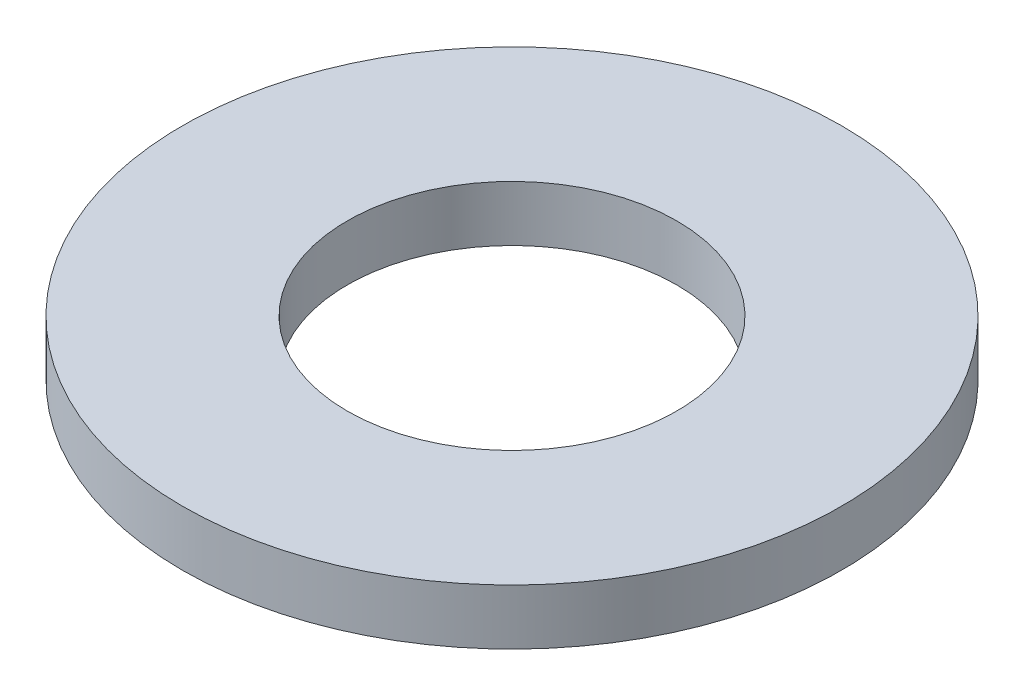
ISO-10303-21;
HEADER;
FILE_DESCRIPTION(('STEP AP214'),'2;1');
FILE_NAME('part.step','',(''),(''),'','','');
FILE_SCHEMA(('AUTOMOTIVE_DESIGN { 1 0 10303 214 1 1 1 1 }'));
ENDSEC;
DATA;
#1=APPLICATION_CONTEXT('core data for automotive mechanical design processes');
#2=APPLICATION_PROTOCOL_DEFINITION('international standard','automotive_design',2000,#1);
#3=PRODUCT_CONTEXT('',#1,'mechanical');
#4=PRODUCT('Part','Part','',(#3));
#5=PRODUCT_RELATED_PRODUCT_CATEGORY('part','',(#4));
#6=PRODUCT_DEFINITION_FORMATION('','',#4);
#7=PRODUCT_DEFINITION_CONTEXT('part definition',#1,'design');
#8=PRODUCT_DEFINITION('design','',#6,#7);
#9=PRODUCT_DEFINITION_SHAPE('','',#8);
#10=(LENGTH_UNIT() NAMED_UNIT(*) SI_UNIT(.MILLI.,.METRE.));
#11=(NAMED_UNIT(*) PLANE_ANGLE_UNIT() SI_UNIT($,.RADIAN.));
#12=(NAMED_UNIT(*) SI_UNIT($,.STERADIAN.) SOLID_ANGLE_UNIT());
#13=UNCERTAINTY_MEASURE_WITH_UNIT(LENGTH_MEASURE(1.E-05),#10,'distance_accuracy_value','');
#14=(GEOMETRIC_REPRESENTATION_CONTEXT(3) GLOBAL_UNCERTAINTY_ASSIGNED_CONTEXT((#13)) GLOBAL_UNIT_ASSIGNED_CONTEXT((#10,
#11,#12)) REPRESENTATION_CONTEXT('',''));
#15=CARTESIAN_POINT('',(0.,0.,0.));
#16=DIRECTION('',(0.,0.,1.));
#17=DIRECTION('',(1.,0.,0.));
#18=AXIS2_PLACEMENT_3D('',#15,#16,#17);
#19=CARTESIAN_POINT('',(0.,16.,0.));
#20=DIRECTION('',(0.,-1.,0.));
#21=DIRECTION('',(0.,0.,-1.));
#22=AXIS2_PLACEMENT_3D('',#19,#20,#21);
#23=CYLINDRICAL_SURFACE('',#22,95.);
#24=CARTESIAN_POINT('',(0.,16.,0.));
#25=DIRECTION('',(0.,1.,0.));
#26=DIRECTION('',(0.,0.,1.));
#27=AXIS2_PLACEMENT_3D('',#24,#25,#26);
#28=CIRCLE('',#27,95.);
#29=CARTESIAN_POINT('',(0.,16.,95.));
#30=VERTEX_POINT('',#29);
#31=EDGE_CURVE('E10',#30,#30,#28,.T.);
#32=ORIENTED_EDGE('',*,*,#31,.F.);
#33=EDGE_LOOP('',(#32));
#34=FACE_BOUND('',#33,.T.);
#35=CARTESIAN_POINT('',(0.,0.,0.));
#36=DIRECTION('',(0.,1.,0.));
#37=DIRECTION('',(0.,0.,1.));
#38=AXIS2_PLACEMENT_3D('',#35,#36,#37);
#39=CIRCLE('',#38,95.);
#40=CARTESIAN_POINT('',(0.,0.,95.));
#41=VERTEX_POINT('',#40);
#42=EDGE_CURVE('E37',#41,#41,#39,.T.);
#43=ORIENTED_EDGE('',*,*,#42,.T.);
#44=EDGE_LOOP('',(#43));
#45=FACE_BOUND('',#44,.T.);
#46=ADVANCED_FACE('F40',(#34,#45),#23,.T.);
#47=CARTESIAN_POINT('',(0.,16.,0.));
#48=DIRECTION('',(0.,1.,0.));
#49=DIRECTION('',(0.,0.,1.));
#50=AXIS2_PLACEMENT_3D('',#47,#48,#49);
#51=PLANE('',#50);
#52=CARTESIAN_POINT('',(0.,16.,0.));
#53=DIRECTION('',(0.,1.,0.));
#54=DIRECTION('',(0.,0.,1.));
#55=AXIS2_PLACEMENT_3D('',#52,#53,#54);
#56=CIRCLE('',#55,47.5);
#57=CARTESIAN_POINT('',(0.,16.,47.5));
#58=VERTEX_POINT('',#57);
#59=EDGE_CURVE('E50',#58,#58,#56,.T.);
#60=ORIENTED_EDGE('',*,*,#59,.F.);
#61=EDGE_LOOP('',(#60));
#62=FACE_BOUND('',#61,.T.);
#63=ORIENTED_EDGE('',*,*,#31,.T.);
#64=EDGE_LOOP('',(#63));
#65=FACE_BOUND('',#64,.T.);
#66=ADVANCED_FACE('F59',(#62,#65),#51,.T.);
#67=CARTESIAN_POINT('',(0.,0.,0.));
#68=DIRECTION('',(0.,1.,0.));
#69=DIRECTION('',(0.,0.,1.));
#70=AXIS2_PLACEMENT_3D('',#67,#68,#69);
#71=PLANE('',#70);
#72=CARTESIAN_POINT('',(0.,0.,0.));
#73=DIRECTION('',(0.,1.,0.));
#74=DIRECTION('',(0.,0.,1.));
#75=AXIS2_PLACEMENT_3D('',#72,#73,#74);
#76=CIRCLE('',#75,47.5);
#77=CARTESIAN_POINT('',(0.,0.,47.5));
#78=VERTEX_POINT('',#77);
#79=EDGE_CURVE('E47',#78,#78,#76,.T.);
#80=ORIENTED_EDGE('',*,*,#79,.T.);
#81=EDGE_LOOP('',(#80));
#82=FACE_BOUND('',#81,.T.);
#83=ORIENTED_EDGE('',*,*,#42,.F.);
#84=EDGE_LOOP('',(#83));
#85=FACE_BOUND('',#84,.T.);
#86=ADVANCED_FACE('F58',(#82,#85),#71,.F.);
#87=CARTESIAN_POINT('',(0.,16.,0.));
#88=DIRECTION('',(0.,-1.,0.));
#89=DIRECTION('',(0.,0.,-1.));
#90=AXIS2_PLACEMENT_3D('',#87,#88,#89);
#91=CYLINDRICAL_SURFACE('',#90,47.5);
#92=ORIENTED_EDGE('',*,*,#59,.T.);
#93=EDGE_LOOP('',(#92));
#94=FACE_BOUND('',#93,.T.);
#95=ORIENTED_EDGE('',*,*,#79,.F.);
#96=EDGE_LOOP('',(#95));
#97=FACE_BOUND('',#96,.T.);
#98=ADVANCED_FACE('F54',(#94,#97),#91,.F.);
#99=CLOSED_SHELL('',(#46,#66,#86,#98));
#100=MANIFOLD_SOLID_BREP('B2',#99);
#101=ADVANCED_BREP_SHAPE_REPRESENTATION('',(#18,#100),#14);
#102=SHAPE_DEFINITION_REPRESENTATION(#9,#101);
ENDSEC;
END-ISO-10303-21;
